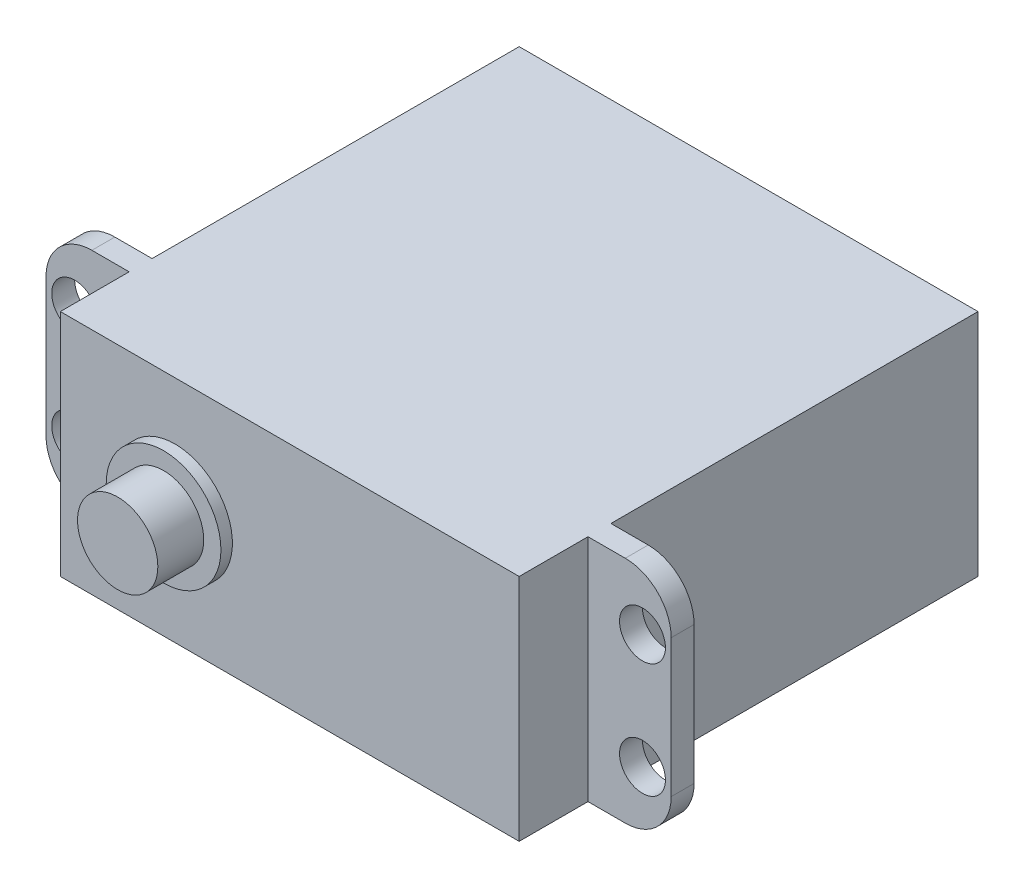
ISO-10303-21;
HEADER;
FILE_DESCRIPTION(('STEP AP214'),'2;1');
FILE_NAME('part.step','',(''),(''),'','','');
FILE_SCHEMA(('AUTOMOTIVE_DESIGN { 1 0 10303 214 1 1 1 1 }'));
ENDSEC;
DATA;
#1=APPLICATION_CONTEXT('core data for automotive mechanical design processes');
#2=APPLICATION_PROTOCOL_DEFINITION('international standard','automotive_design',2000,#1);
#3=PRODUCT_CONTEXT('',#1,'mechanical');
#4=PRODUCT('Part','Part','',(#3));
#5=PRODUCT_RELATED_PRODUCT_CATEGORY('part','',(#4));
#6=PRODUCT_DEFINITION_FORMATION('','',#4);
#7=PRODUCT_DEFINITION_CONTEXT('part definition',#1,'design');
#8=PRODUCT_DEFINITION('design','',#6,#7);
#9=PRODUCT_DEFINITION_SHAPE('','',#8);
#10=(LENGTH_UNIT() NAMED_UNIT(*) SI_UNIT(.MILLI.,.METRE.));
#11=(NAMED_UNIT(*) PLANE_ANGLE_UNIT() SI_UNIT($,.RADIAN.));
#12=(NAMED_UNIT(*) SI_UNIT($,.STERADIAN.) SOLID_ANGLE_UNIT());
#13=UNCERTAINTY_MEASURE_WITH_UNIT(LENGTH_MEASURE(1.E-05),#10,'distance_accuracy_value','');
#14=(GEOMETRIC_REPRESENTATION_CONTEXT(3) GLOBAL_UNCERTAINTY_ASSIGNED_CONTEXT((#13)) GLOBAL_UNIT_ASSIGNED_CONTEXT((#10,
#11,#12)) REPRESENTATION_CONTEXT('',''));
#15=CARTESIAN_POINT('',(0.,0.,0.));
#16=DIRECTION('',(0.,0.,1.));
#17=DIRECTION('',(1.,0.,0.));
#18=AXIS2_PLACEMENT_3D('',#15,#16,#17);
#19=CARTESIAN_POINT('',(-20.,-10.,40.));
#20=DIRECTION('',(-1.,0.,0.));
#21=DIRECTION('',(0.,0.,1.));
#22=AXIS2_PLACEMENT_3D('',#19,#20,#21);
#23=PLANE('',#22);
#24=DIRECTION('',(0.,-1.,0.));
#25=VECTOR('',#24,1.);
#26=CARTESIAN_POINT('',(-20.,10.,32.));
#27=LINE('',#26,#25);
#28=CARTESIAN_POINT('',(-20.,10.,32.));
#29=VERTEX_POINT('',#28);
#30=CARTESIAN_POINT('',(-20.,-10.,32.));
#31=VERTEX_POINT('',#30);
#32=EDGE_CURVE('E191',#29,#31,#27,.T.);
#33=ORIENTED_EDGE('',*,*,#32,.F.);
#34=DIRECTION('',(0.,0.,-1.));
#35=VECTOR('',#34,1.);
#36=CARTESIAN_POINT('',(-20.,10.,40.));
#37=LINE('',#36,#35);
#38=CARTESIAN_POINT('',(-20.,10.,0.));
#39=VERTEX_POINT('',#38);
#40=EDGE_CURVE('E186',#29,#39,#37,.T.);
#41=ORIENTED_EDGE('',*,*,#40,.T.);
#42=DIRECTION('',(0.,1.,0.));
#43=VECTOR('',#42,1.);
#44=CARTESIAN_POINT('',(-20.,-10.,0.));
#45=LINE('',#44,#43);
#46=CARTESIAN_POINT('',(-20.,-10.,0.));
#47=VERTEX_POINT('',#46);
#48=EDGE_CURVE('E249',#47,#39,#45,.T.);
#49=ORIENTED_EDGE('',*,*,#48,.F.);
#50=DIRECTION('',(0.,0.,-1.));
#51=VECTOR('',#50,1.);
#52=CARTESIAN_POINT('',(-20.,-10.,40.));
#53=LINE('',#52,#51);
#54=EDGE_CURVE('E288',#31,#47,#53,.T.);
#55=ORIENTED_EDGE('',*,*,#54,.F.);
#56=EDGE_LOOP('',(#33,#41,#49,#55));
#57=FACE_BOUND('',#56,.T.);
#58=ADVANCED_FACE('F45',(#57),#23,.T.);
#59=CARTESIAN_POINT('',(20.,-10.,40.));
#60=DIRECTION('',(-1.,0.,0.));
#61=DIRECTION('',(0.,0.,1.));
#62=AXIS2_PLACEMENT_3D('',#59,#60,#61);
#63=PLANE('',#62);
#64=DIRECTION('',(0.,0.,-1.));
#65=VECTOR('',#64,1.);
#66=CARTESIAN_POINT('',(20.,-10.,40.));
#67=LINE('',#66,#65);
#68=CARTESIAN_POINT('',(20.,-10.,40.));
#69=VERTEX_POINT('',#68);
#70=CARTESIAN_POINT('',(20.,-10.,34.));
#71=VERTEX_POINT('',#70);
#72=EDGE_CURVE('E289',#69,#71,#67,.T.);
#73=ORIENTED_EDGE('',*,*,#72,.T.);
#74=DIRECTION('',(0.,1.,0.));
#75=VECTOR('',#74,1.);
#76=CARTESIAN_POINT('',(20.,-10.,34.));
#77=LINE('',#76,#75);
#78=CARTESIAN_POINT('',(20.,10.,34.));
#79=VERTEX_POINT('',#78);
#80=EDGE_CURVE('E218',#71,#79,#77,.T.);
#81=ORIENTED_EDGE('',*,*,#80,.T.);
#82=DIRECTION('',(0.,0.,-1.));
#83=VECTOR('',#82,1.);
#84=CARTESIAN_POINT('',(20.,10.,40.));
#85=LINE('',#84,#83);
#86=CARTESIAN_POINT('',(20.,10.,40.));
#87=VERTEX_POINT('',#86);
#88=EDGE_CURVE('E294',#87,#79,#85,.T.);
#89=ORIENTED_EDGE('',*,*,#88,.F.);
#90=DIRECTION('',(0.,1.,0.));
#91=VECTOR('',#90,1.);
#92=CARTESIAN_POINT('',(20.,-10.,40.));
#93=LINE('',#92,#91);
#94=EDGE_CURVE('E264',#69,#87,#93,.T.);
#95=ORIENTED_EDGE('',*,*,#94,.F.);
#96=EDGE_LOOP('',(#73,#81,#89,#95));
#97=FACE_BOUND('',#96,.T.);
#98=ADVANCED_FACE('F392',(#97),#63,.F.);
#99=DIRECTION('',(0.,1.,0.));
#100=VECTOR('',#99,1.);
#101=CARTESIAN_POINT('',(-20.,-10.,34.));
#102=LINE('',#101,#100);
#103=CARTESIAN_POINT('',(-20.,-10.,34.));
#104=VERTEX_POINT('',#103);
#105=CARTESIAN_POINT('',(-20.,10.,34.));
#106=VERTEX_POINT('',#105);
#107=EDGE_CURVE('E180',#104,#106,#102,.T.);
#108=ORIENTED_EDGE('',*,*,#107,.F.);
#109=CARTESIAN_POINT('',(-20.,-10.,40.));
#110=VERTEX_POINT('',#109);
#111=EDGE_CURVE('E284',#110,#104,#53,.T.);
#112=ORIENTED_EDGE('',*,*,#111,.F.);
#113=DIRECTION('',(0.,1.,0.));
#114=VECTOR('',#113,1.);
#115=CARTESIAN_POINT('',(-20.,-10.,40.));
#116=LINE('',#115,#114);
#117=CARTESIAN_POINT('',(-20.,10.,40.));
#118=VERTEX_POINT('',#117);
#119=EDGE_CURVE('E183',#110,#118,#116,.T.);
#120=ORIENTED_EDGE('',*,*,#119,.T.);
#121=EDGE_CURVE('E165',#118,#106,#37,.T.);
#122=ORIENTED_EDGE('',*,*,#121,.T.);
#123=EDGE_LOOP('',(#108,#112,#120,#122));
#124=FACE_BOUND('',#123,.T.);
#125=ADVANCED_FACE('F179',(#124),#23,.T.);
#126=CARTESIAN_POINT('',(-20.,-10.,40.));
#127=DIRECTION('',(0.,1.,0.));
#128=DIRECTION('',(0.,0.,1.));
#129=AXIS2_PLACEMENT_3D('',#126,#127,#128);
#130=PLANE('',#129);
#131=DIRECTION('',(1.,0.,0.));
#132=VECTOR('',#131,1.);
#133=CARTESIAN_POINT('',(-27.25,-10.,34.));
#134=LINE('',#133,#132);
#135=CARTESIAN_POINT('',(-23.25,-10.,34.));
#136=VERTEX_POINT('',#135);
#137=EDGE_CURVE('E173',#136,#104,#134,.T.);
#138=ORIENTED_EDGE('',*,*,#137,.F.);
#139=DIRECTION('',(0.,0.,1.));
#140=VECTOR('',#139,1.);
#141=CARTESIAN_POINT('',(-23.25,-10.,32.));
#142=LINE('',#141,#140);
#143=CARTESIAN_POINT('',(-23.25,-10.,32.));
#144=VERTEX_POINT('',#143);
#145=EDGE_CURVE('E71',#136,#144,#142,.F.);
#146=ORIENTED_EDGE('',*,*,#145,.T.);
#147=DIRECTION('',(1.,0.,0.));
#148=VECTOR('',#147,1.);
#149=CARTESIAN_POINT('',(-27.25,-10.,32.));
#150=LINE('',#149,#148);
#151=EDGE_CURVE('E206',#144,#31,#150,.T.);
#152=ORIENTED_EDGE('',*,*,#151,.T.);
#153=ORIENTED_EDGE('',*,*,#54,.T.);
#154=DIRECTION('',(1.,0.,0.));
#155=VECTOR('',#154,1.);
#156=CARTESIAN_POINT('',(-20.,-10.,0.));
#157=LINE('',#156,#155);
#158=CARTESIAN_POINT('',(20.,-10.,0.));
#159=VERTEX_POINT('',#158);
#160=EDGE_CURVE('E261',#47,#159,#157,.T.);
#161=ORIENTED_EDGE('',*,*,#160,.T.);
#162=CARTESIAN_POINT('',(20.,-10.,32.));
#163=VERTEX_POINT('',#162);
#164=EDGE_CURVE('E293',#163,#159,#67,.T.);
#165=ORIENTED_EDGE('',*,*,#164,.F.);
#166=DIRECTION('',(-1.,0.,0.));
#167=VECTOR('',#166,1.);
#168=CARTESIAN_POINT('',(27.25,-10.,32.));
#169=LINE('',#168,#167);
#170=CARTESIAN_POINT('',(23.25,-10.,32.));
#171=VERTEX_POINT('',#170);
#172=EDGE_CURVE('E246',#171,#163,#169,.T.);
#173=ORIENTED_EDGE('',*,*,#172,.F.);
#174=DIRECTION('',(0.,0.,1.));
#175=VECTOR('',#174,1.);
#176=CARTESIAN_POINT('',(23.25,-10.,40.));
#177=LINE('',#176,#175);
#178=CARTESIAN_POINT('',(23.25,-10.,34.));
#179=VERTEX_POINT('',#178);
#180=EDGE_CURVE('E319',#171,#179,#177,.T.);
#181=ORIENTED_EDGE('',*,*,#180,.T.);
#182=DIRECTION('',(-1.,0.,0.));
#183=VECTOR('',#182,1.);
#184=CARTESIAN_POINT('',(27.25,-10.,34.));
#185=LINE('',#184,#183);
#186=EDGE_CURVE('E239',#179,#71,#185,.T.);
#187=ORIENTED_EDGE('',*,*,#186,.T.);
#188=ORIENTED_EDGE('',*,*,#72,.F.);
#189=DIRECTION('',(1.,0.,0.));
#190=VECTOR('',#189,1.);
#191=CARTESIAN_POINT('',(-20.,-10.,40.));
#192=LINE('',#191,#190);
#193=EDGE_CURVE('E267',#110,#69,#192,.T.);
#194=ORIENTED_EDGE('',*,*,#193,.F.);
#195=ORIENTED_EDGE('',*,*,#111,.T.);
#196=EDGE_LOOP('',(#138,#146,#152,#153,#161,#165,#173,#181,#187,#188,#194,#195));
#197=FACE_BOUND('',#196,.T.);
#198=ADVANCED_FACE('F382',(#197),#130,.F.);
#199=CARTESIAN_POINT('',(20.,10.,32.));
#200=VERTEX_POINT('',#199);
#201=CARTESIAN_POINT('',(20.,10.,0.));
#202=VERTEX_POINT('',#201);
#203=EDGE_CURVE('E185',#200,#202,#85,.T.);
#204=ORIENTED_EDGE('',*,*,#203,.F.);
#205=DIRECTION('',(0.,-1.,0.));
#206=VECTOR('',#205,1.);
#207=CARTESIAN_POINT('',(20.,10.,32.));
#208=LINE('',#207,#206);
#209=EDGE_CURVE('E235',#200,#163,#208,.T.);
#210=ORIENTED_EDGE('',*,*,#209,.T.);
#211=ORIENTED_EDGE('',*,*,#164,.T.);
#212=DIRECTION('',(0.,1.,0.));
#213=VECTOR('',#212,1.);
#214=CARTESIAN_POINT('',(20.,-10.,0.));
#215=LINE('',#214,#213);
#216=EDGE_CURVE('E277',#159,#202,#215,.T.);
#217=ORIENTED_EDGE('',*,*,#216,.T.);
#218=EDGE_LOOP('',(#204,#210,#211,#217));
#219=FACE_BOUND('',#218,.T.);
#220=ADVANCED_FACE('F411',(#219),#63,.F.);
#221=CARTESIAN_POINT('',(-20.,10.,40.));
#222=DIRECTION('',(0.,1.,0.));
#223=DIRECTION('',(0.,0.,1.));
#224=AXIS2_PLACEMENT_3D('',#221,#222,#223);
#225=PLANE('',#224);
#226=DIRECTION('',(1.,0.,0.));
#227=VECTOR('',#226,1.);
#228=CARTESIAN_POINT('',(-27.25,10.,32.));
#229=LINE('',#228,#227);
#230=CARTESIAN_POINT('',(-23.25,10.,32.));
#231=VERTEX_POINT('',#230);
#232=EDGE_CURVE('E174',#231,#29,#229,.T.);
#233=ORIENTED_EDGE('',*,*,#232,.F.);
#234=DIRECTION('',(0.,0.,-1.));
#235=VECTOR('',#234,1.);
#236=CARTESIAN_POINT('',(-23.25,10.,40.));
#237=LINE('',#236,#235);
#238=CARTESIAN_POINT('',(-23.25,10.,34.));
#239=VERTEX_POINT('',#238);
#240=EDGE_CURVE('E168',#231,#239,#237,.F.);
#241=ORIENTED_EDGE('',*,*,#240,.T.);
#242=DIRECTION('',(1.,0.,0.));
#243=VECTOR('',#242,1.);
#244=CARTESIAN_POINT('',(-27.25,10.,34.));
#245=LINE('',#244,#243);
#246=EDGE_CURVE('E161',#239,#106,#245,.T.);
#247=ORIENTED_EDGE('',*,*,#246,.T.);
#248=ORIENTED_EDGE('',*,*,#121,.F.);
#249=DIRECTION('',(1.,0.,0.));
#250=VECTOR('',#249,1.);
#251=CARTESIAN_POINT('',(-20.,10.,40.));
#252=LINE('',#251,#250);
#253=EDGE_CURVE('E260',#118,#87,#252,.T.);
#254=ORIENTED_EDGE('',*,*,#253,.T.);
#255=ORIENTED_EDGE('',*,*,#88,.T.);
#256=DIRECTION('',(-1.,0.,0.));
#257=VECTOR('',#256,1.);
#258=CARTESIAN_POINT('',(27.25,10.,34.));
#259=LINE('',#258,#257);
#260=CARTESIAN_POINT('',(23.25,10.,34.));
#261=VERTEX_POINT('',#260);
#262=EDGE_CURVE('E253',#261,#79,#259,.T.);
#263=ORIENTED_EDGE('',*,*,#262,.F.);
#264=DIRECTION('',(0.,0.,-1.));
#265=VECTOR('',#264,1.);
#266=CARTESIAN_POINT('',(23.25,10.,32.));
#267=LINE('',#266,#265);
#268=CARTESIAN_POINT('',(23.25,10.,32.));
#269=VERTEX_POINT('',#268);
#270=EDGE_CURVE('E287',#261,#269,#267,.T.);
#271=ORIENTED_EDGE('',*,*,#270,.T.);
#272=DIRECTION('',(-1.,0.,0.));
#273=VECTOR('',#272,1.);
#274=CARTESIAN_POINT('',(27.25,10.,32.));
#275=LINE('',#274,#273);
#276=EDGE_CURVE('E250',#269,#200,#275,.T.);
#277=ORIENTED_EDGE('',*,*,#276,.T.);
#278=ORIENTED_EDGE('',*,*,#203,.T.);
#279=DIRECTION('',(1.,0.,0.));
#280=VECTOR('',#279,1.);
#281=CARTESIAN_POINT('',(-20.,10.,0.));
#282=LINE('',#281,#280);
#283=EDGE_CURVE('E273',#39,#202,#282,.T.);
#284=ORIENTED_EDGE('',*,*,#283,.F.);
#285=ORIENTED_EDGE('',*,*,#40,.F.);
#286=EDGE_LOOP('',(#233,#241,#247,#248,#254,#255,#263,#271,#277,#278,#284,#285));
#287=FACE_BOUND('',#286,.T.);
#288=ADVANCED_FACE('F163',(#287),#225,.T.);
#289=CARTESIAN_POINT('',(0.,0.,40.));
#290=DIRECTION('',(0.,0.,-1.));
#291=DIRECTION('',(-1.,0.,0.));
#292=AXIS2_PLACEMENT_3D('',#289,#290,#291);
#293=PLANE('',#292);
#294=CARTESIAN_POINT('',(-10.,0.,40.));
#295=DIRECTION('',(0.,0.,-1.));
#296=DIRECTION('',(-1.,0.,0.));
#297=AXIS2_PLACEMENT_3D('',#294,#295,#296);
#298=CIRCLE('',#297,5.);
#299=CARTESIAN_POINT('',(-15.,0.,40.));
#300=VERTEX_POINT('',#299);
#301=EDGE_CURVE('E49',#300,#300,#298,.F.);
#302=ORIENTED_EDGE('',*,*,#301,.F.);
#303=EDGE_LOOP('',(#302));
#304=FACE_BOUND('',#303,.T.);
#305=ORIENTED_EDGE('',*,*,#119,.F.);
#306=ORIENTED_EDGE('',*,*,#193,.T.);
#307=ORIENTED_EDGE('',*,*,#94,.T.);
#308=ORIENTED_EDGE('',*,*,#253,.F.);
#309=EDGE_LOOP('',(#305,#306,#307,#308));
#310=FACE_BOUND('',#309,.T.);
#311=ADVANCED_FACE('F387',(#304,#310),#293,.F.);
#312=CARTESIAN_POINT('',(0.,0.,0.));
#313=DIRECTION('',(0.,0.,-1.));
#314=DIRECTION('',(-1.,0.,0.));
#315=AXIS2_PLACEMENT_3D('',#312,#313,#314);
#316=PLANE('',#315);
#317=CARTESIAN_POINT('',(-10.,0.,0.));
#318=DIRECTION('',(0.,0.,-1.));
#319=DIRECTION('',(-1.,0.,0.));
#320=AXIS2_PLACEMENT_3D('',#317,#318,#319);
#321=CIRCLE('',#320,5.);
#322=CARTESIAN_POINT('',(-15.,0.,0.));
#323=VERTEX_POINT('',#322);
#324=EDGE_CURVE('E533',#323,#323,#321,.T.);
#325=ORIENTED_EDGE('',*,*,#324,.F.);
#326=EDGE_LOOP('',(#325));
#327=FACE_BOUND('',#326,.T.);
#328=ORIENTED_EDGE('',*,*,#48,.T.);
#329=ORIENTED_EDGE('',*,*,#283,.T.);
#330=ORIENTED_EDGE('',*,*,#216,.F.);
#331=ORIENTED_EDGE('',*,*,#160,.F.);
#332=EDGE_LOOP('',(#328,#329,#330,#331));
#333=FACE_BOUND('',#332,.T.);
#334=ADVANCED_FACE('F424',(#327,#333),#316,.T.);
#335=CARTESIAN_POINT('',(27.25,10.,32.));
#336=DIRECTION('',(0.,0.,-1.));
#337=DIRECTION('',(-1.,0.,0.));
#338=AXIS2_PLACEMENT_3D('',#335,#336,#337);
#339=PLANE('',#338);
#340=CARTESIAN_POINT('',(24.75,4.99942998703595,32.));
#341=DIRECTION('',(0.,0.,1.));
#342=DIRECTION('',(1.,0.,0.));
#343=AXIS2_PLACEMENT_3D('',#340,#341,#342);
#344=CIRCLE('',#343,2.);
#345=CARTESIAN_POINT('',(26.75,4.99942998703595,32.));
#346=VERTEX_POINT('',#345);
#347=EDGE_CURVE('E214',#346,#346,#344,.T.);
#348=ORIENTED_EDGE('',*,*,#347,.T.);
#349=EDGE_LOOP('',(#348));
#350=FACE_BOUND('',#349,.T.);
#351=CARTESIAN_POINT('',(24.75,-4.99913934048573,32.));
#352=DIRECTION('',(0.,0.,1.));
#353=DIRECTION('',(1.,0.,0.));
#354=AXIS2_PLACEMENT_3D('',#351,#352,#353);
#355=CIRCLE('',#354,2.);
#356=CARTESIAN_POINT('',(26.75,-4.99913934048573,32.));
#357=VERTEX_POINT('',#356);
#358=EDGE_CURVE('E213',#357,#357,#355,.T.);
#359=ORIENTED_EDGE('',*,*,#358,.T.);
#360=EDGE_LOOP('',(#359));
#361=FACE_BOUND('',#360,.T.);
#362=ORIENTED_EDGE('',*,*,#276,.F.);
#363=CARTESIAN_POINT('',(23.25,6.,32.));
#364=DIRECTION('',(0.,0.,-1.));
#365=DIRECTION('',(-1.,0.,0.));
#366=AXIS2_PLACEMENT_3D('',#363,#364,#365);
#367=CIRCLE('',#366,4.);
#368=CARTESIAN_POINT('',(27.25,6.,32.));
#369=VERTEX_POINT('',#368);
#370=EDGE_CURVE('E304',#269,#369,#367,.T.);
#371=ORIENTED_EDGE('',*,*,#370,.T.);
#372=DIRECTION('',(0.,-1.,0.));
#373=VECTOR('',#372,1.);
#374=CARTESIAN_POINT('',(27.25,10.,32.));
#375=LINE('',#374,#373);
#376=CARTESIAN_POINT('',(27.25,-6.,32.));
#377=VERTEX_POINT('',#376);
#378=EDGE_CURVE('E234',#369,#377,#375,.T.);
#379=ORIENTED_EDGE('',*,*,#378,.T.);
#380=CARTESIAN_POINT('',(23.25,-6.,32.));
#381=DIRECTION('',(0.,0.,-1.));
#382=DIRECTION('',(-1.,0.,0.));
#383=AXIS2_PLACEMENT_3D('',#380,#381,#382);
#384=CIRCLE('',#383,4.);
#385=EDGE_CURVE('E301',#377,#171,#384,.T.);
#386=ORIENTED_EDGE('',*,*,#385,.T.);
#387=ORIENTED_EDGE('',*,*,#172,.T.);
#388=ORIENTED_EDGE('',*,*,#209,.F.);
#389=EDGE_LOOP('',(#362,#371,#379,#386,#387,#388));
#390=FACE_BOUND('',#389,.T.);
#391=ADVANCED_FACE('F405',(#350,#361,#390),#339,.T.);
#392=CARTESIAN_POINT('',(27.25,-10.,34.));
#393=DIRECTION('',(0.,0.,1.));
#394=DIRECTION('',(1.,0.,0.));
#395=AXIS2_PLACEMENT_3D('',#392,#393,#394);
#396=PLANE('',#395);
#397=CARTESIAN_POINT('',(24.75,4.99942998703595,34.));
#398=DIRECTION('',(0.,0.,1.));
#399=DIRECTION('',(1.,0.,0.));
#400=AXIS2_PLACEMENT_3D('',#397,#398,#399);
#401=CIRCLE('',#400,2.);
#402=CARTESIAN_POINT('',(26.75,4.99942998703595,34.));
#403=VERTEX_POINT('',#402);
#404=EDGE_CURVE('E219',#403,#403,#401,.T.);
#405=ORIENTED_EDGE('',*,*,#404,.F.);
#406=EDGE_LOOP('',(#405));
#407=FACE_BOUND('',#406,.T.);
#408=CARTESIAN_POINT('',(24.75,-4.99913934048573,34.));
#409=DIRECTION('',(0.,0.,1.));
#410=DIRECTION('',(1.,0.,0.));
#411=AXIS2_PLACEMENT_3D('',#408,#409,#410);
#412=CIRCLE('',#411,2.);
#413=CARTESIAN_POINT('',(26.75,-4.99913934048573,34.));
#414=VERTEX_POINT('',#413);
#415=EDGE_CURVE('E223',#414,#414,#412,.T.);
#416=ORIENTED_EDGE('',*,*,#415,.F.);
#417=EDGE_LOOP('',(#416));
#418=FACE_BOUND('',#417,.T.);
#419=DIRECTION('',(0.,1.,0.));
#420=VECTOR('',#419,1.);
#421=CARTESIAN_POINT('',(27.25,-10.,34.));
#422=LINE('',#421,#420);
#423=CARTESIAN_POINT('',(27.25,-6.,34.));
#424=VERTEX_POINT('',#423);
#425=CARTESIAN_POINT('',(27.25,6.,34.));
#426=VERTEX_POINT('',#425);
#427=EDGE_CURVE('E230',#424,#426,#422,.T.);
#428=ORIENTED_EDGE('',*,*,#427,.T.);
#429=CARTESIAN_POINT('',(23.25,6.,34.));
#430=DIRECTION('',(0.,0.,1.));
#431=DIRECTION('',(1.,0.,0.));
#432=AXIS2_PLACEMENT_3D('',#429,#430,#431);
#433=CIRCLE('',#432,4.);
#434=EDGE_CURVE('E316',#426,#261,#433,.T.);
#435=ORIENTED_EDGE('',*,*,#434,.T.);
#436=ORIENTED_EDGE('',*,*,#262,.T.);
#437=ORIENTED_EDGE('',*,*,#80,.F.);
#438=ORIENTED_EDGE('',*,*,#186,.F.);
#439=CARTESIAN_POINT('',(23.25,-6.,34.));
#440=DIRECTION('',(0.,0.,1.));
#441=DIRECTION('',(1.,0.,0.));
#442=AXIS2_PLACEMENT_3D('',#439,#440,#441);
#443=CIRCLE('',#442,4.);
#444=EDGE_CURVE('E313',#179,#424,#443,.T.);
#445=ORIENTED_EDGE('',*,*,#444,.T.);
#446=EDGE_LOOP('',(#428,#435,#436,#437,#438,#445));
#447=FACE_BOUND('',#446,.T.);
#448=ADVANCED_FACE('F396',(#407,#418,#447),#396,.T.);
#449=CARTESIAN_POINT('',(27.25,0.,0.));
#450=DIRECTION('',(-1.,0.,0.));
#451=DIRECTION('',(0.,0.,1.));
#452=AXIS2_PLACEMENT_3D('',#449,#450,#451);
#453=PLANE('',#452);
#454=ORIENTED_EDGE('',*,*,#378,.F.);
#455=DIRECTION('',(0.,0.,-1.));
#456=VECTOR('',#455,1.);
#457=CARTESIAN_POINT('',(27.25,6.,34.));
#458=LINE('',#457,#456);
#459=EDGE_CURVE('E310',#369,#426,#458,.F.);
#460=ORIENTED_EDGE('',*,*,#459,.T.);
#461=ORIENTED_EDGE('',*,*,#427,.F.);
#462=DIRECTION('',(0.,0.,1.));
#463=VECTOR('',#462,1.);
#464=CARTESIAN_POINT('',(27.25,-6.,0.));
#465=LINE('',#464,#463);
#466=EDGE_CURVE('E307',#424,#377,#465,.F.);
#467=ORIENTED_EDGE('',*,*,#466,.T.);
#468=EDGE_LOOP('',(#454,#460,#461,#467));
#469=FACE_BOUND('',#468,.T.);
#470=ADVANCED_FACE('F472',(#469),#453,.F.);
#471=CARTESIAN_POINT('',(24.75,-4.99913934048573,32.));
#472=DIRECTION('',(0.,0.,1.));
#473=DIRECTION('',(1.,0.,0.));
#474=AXIS2_PLACEMENT_3D('',#471,#472,#473);
#475=CYLINDRICAL_SURFACE('',#474,2.);
#476=ORIENTED_EDGE('',*,*,#358,.F.);
#477=EDGE_LOOP('',(#476));
#478=FACE_BOUND('',#477,.T.);
#479=ORIENTED_EDGE('',*,*,#415,.T.);
#480=EDGE_LOOP('',(#479));
#481=FACE_BOUND('',#480,.T.);
#482=ADVANCED_FACE('F479',(#478,#481),#475,.F.);
#483=CARTESIAN_POINT('',(24.75,4.99942998703595,32.));
#484=DIRECTION('',(0.,0.,1.));
#485=DIRECTION('',(1.,0.,0.));
#486=AXIS2_PLACEMENT_3D('',#483,#484,#485);
#487=CYLINDRICAL_SURFACE('',#486,2.);
#488=ORIENTED_EDGE('',*,*,#347,.F.);
#489=EDGE_LOOP('',(#488));
#490=FACE_BOUND('',#489,.T.);
#491=ORIENTED_EDGE('',*,*,#404,.T.);
#492=EDGE_LOOP('',(#491));
#493=FACE_BOUND('',#492,.T.);
#494=ADVANCED_FACE('F483',(#490,#493),#487,.F.);
#495=CARTESIAN_POINT('',(23.25,6.,40.));
#496=DIRECTION('',(0.,0.,1.));
#497=DIRECTION('',(1.,0.,0.));
#498=AXIS2_PLACEMENT_3D('',#495,#496,#497);
#499=CYLINDRICAL_SURFACE('',#498,4.);
#500=ORIENTED_EDGE('',*,*,#434,.F.);
#501=ORIENTED_EDGE('',*,*,#459,.F.);
#502=ORIENTED_EDGE('',*,*,#370,.F.);
#503=ORIENTED_EDGE('',*,*,#270,.F.);
#504=EDGE_LOOP('',(#500,#501,#502,#503));
#505=FACE_BOUND('',#504,.T.);
#506=ADVANCED_FACE('F401',(#505),#499,.T.);
#507=CARTESIAN_POINT('',(23.25,-6.,40.));
#508=DIRECTION('',(0.,0.,1.));
#509=DIRECTION('',(1.,0.,0.));
#510=AXIS2_PLACEMENT_3D('',#507,#508,#509);
#511=CYLINDRICAL_SURFACE('',#510,4.);
#512=ORIENTED_EDGE('',*,*,#385,.F.);
#513=ORIENTED_EDGE('',*,*,#466,.F.);
#514=ORIENTED_EDGE('',*,*,#444,.F.);
#515=ORIENTED_EDGE('',*,*,#180,.F.);
#516=EDGE_LOOP('',(#512,#513,#514,#515));
#517=FACE_BOUND('',#516,.T.);
#518=ADVANCED_FACE('F489',(#517),#511,.T.);
#519=CARTESIAN_POINT('',(-27.25,-10.,34.));
#520=DIRECTION('',(0.,0.,-1.));
#521=DIRECTION('',(-1.,0.,0.));
#522=AXIS2_PLACEMENT_3D('',#519,#520,#521);
#523=PLANE('',#522);
#524=CARTESIAN_POINT('',(-24.75,5.,34.));
#525=DIRECTION('',(0.,0.,1.));
#526=DIRECTION('',(1.,0.,0.));
#527=AXIS2_PLACEMENT_3D('',#524,#525,#526);
#528=CIRCLE('',#527,2.);
#529=CARTESIAN_POINT('',(-22.75,5.,34.));
#530=VERTEX_POINT('',#529);
#531=EDGE_CURVE('E200',#530,#530,#528,.T.);
#532=ORIENTED_EDGE('',*,*,#531,.F.);
#533=EDGE_LOOP('',(#532));
#534=FACE_BOUND('',#533,.T.);
#535=CARTESIAN_POINT('',(-24.75,-5.,34.));
#536=DIRECTION('',(0.,0.,1.));
#537=DIRECTION('',(1.,0.,0.));
#538=AXIS2_PLACEMENT_3D('',#535,#536,#537);
#539=CIRCLE('',#538,2.);
#540=CARTESIAN_POINT('',(-22.75,-5.,34.));
#541=VERTEX_POINT('',#540);
#542=EDGE_CURVE('E365',#541,#541,#539,.T.);
#543=ORIENTED_EDGE('',*,*,#542,.F.);
#544=EDGE_LOOP('',(#543));
#545=FACE_BOUND('',#544,.T.);
#546=DIRECTION('',(0.,1.,0.));
#547=VECTOR('',#546,1.);
#548=CARTESIAN_POINT('',(-27.25,-10.,34.));
#549=LINE('',#548,#547);
#550=CARTESIAN_POINT('',(-27.25,-6.,34.));
#551=VERTEX_POINT('',#550);
#552=CARTESIAN_POINT('',(-27.25,6.,34.));
#553=VERTEX_POINT('',#552);
#554=EDGE_CURVE('E197',#551,#553,#549,.T.);
#555=ORIENTED_EDGE('',*,*,#554,.F.);
#556=CARTESIAN_POINT('',(-23.25,-6.,34.));
#557=DIRECTION('',(0.,0.,-1.));
#558=DIRECTION('',(-1.,0.,0.));
#559=AXIS2_PLACEMENT_3D('',#556,#557,#558);
#560=CIRCLE('',#559,4.);
#561=EDGE_CURVE('E334',#551,#136,#560,.F.);
#562=ORIENTED_EDGE('',*,*,#561,.T.);
#563=ORIENTED_EDGE('',*,*,#137,.T.);
#564=ORIENTED_EDGE('',*,*,#107,.T.);
#565=ORIENTED_EDGE('',*,*,#246,.F.);
#566=CARTESIAN_POINT('',(-23.25,6.,34.));
#567=DIRECTION('',(0.,0.,-1.));
#568=DIRECTION('',(-1.,0.,0.));
#569=AXIS2_PLACEMENT_3D('',#566,#567,#568);
#570=CIRCLE('',#569,4.);
#571=EDGE_CURVE('E331',#239,#553,#570,.F.);
#572=ORIENTED_EDGE('',*,*,#571,.T.);
#573=EDGE_LOOP('',(#555,#562,#563,#564,#565,#572));
#574=FACE_BOUND('',#573,.T.);
#575=ADVANCED_FACE('F189',(#534,#545,#574),#523,.F.);
#576=CARTESIAN_POINT('',(-27.25,10.,32.));
#577=DIRECTION('',(0.,0.,1.));
#578=DIRECTION('',(1.,0.,0.));
#579=AXIS2_PLACEMENT_3D('',#576,#577,#578);
#580=PLANE('',#579);
#581=CARTESIAN_POINT('',(-24.75,5.,32.));
#582=DIRECTION('',(0.,0.,1.));
#583=DIRECTION('',(1.,0.,0.));
#584=AXIS2_PLACEMENT_3D('',#581,#582,#583);
#585=CIRCLE('',#584,2.);
#586=CARTESIAN_POINT('',(-22.75,5.,32.));
#587=VERTEX_POINT('',#586);
#588=EDGE_CURVE('E192',#587,#587,#585,.T.);
#589=ORIENTED_EDGE('',*,*,#588,.T.);
#590=EDGE_LOOP('',(#589));
#591=FACE_BOUND('',#590,.T.);
#592=CARTESIAN_POINT('',(-24.75,-5.,32.));
#593=DIRECTION('',(0.,0.,1.));
#594=DIRECTION('',(1.,0.,0.));
#595=AXIS2_PLACEMENT_3D('',#592,#593,#594);
#596=CIRCLE('',#595,2.);
#597=CARTESIAN_POINT('',(-22.75,-5.,32.));
#598=VERTEX_POINT('',#597);
#599=EDGE_CURVE('E360',#598,#598,#596,.T.);
#600=ORIENTED_EDGE('',*,*,#599,.T.);
#601=EDGE_LOOP('',(#600));
#602=FACE_BOUND('',#601,.T.);
#603=ORIENTED_EDGE('',*,*,#151,.F.);
#604=CARTESIAN_POINT('',(-23.25,-6.,32.));
#605=DIRECTION('',(0.,0.,1.));
#606=DIRECTION('',(1.,0.,0.));
#607=AXIS2_PLACEMENT_3D('',#604,#605,#606);
#608=CIRCLE('',#607,4.);
#609=CARTESIAN_POINT('',(-27.25,-6.,32.));
#610=VERTEX_POINT('',#609);
#611=EDGE_CURVE('E341',#144,#610,#608,.F.);
#612=ORIENTED_EDGE('',*,*,#611,.T.);
#613=DIRECTION('',(0.,-1.,0.));
#614=VECTOR('',#613,1.);
#615=CARTESIAN_POINT('',(-27.25,10.,32.));
#616=LINE('',#615,#614);
#617=CARTESIAN_POINT('',(-27.25,6.,32.));
#618=VERTEX_POINT('',#617);
#619=EDGE_CURVE('E203',#618,#610,#616,.T.);
#620=ORIENTED_EDGE('',*,*,#619,.F.);
#621=CARTESIAN_POINT('',(-23.25,6.,32.));
#622=DIRECTION('',(0.,0.,1.));
#623=DIRECTION('',(1.,0.,0.));
#624=AXIS2_PLACEMENT_3D('',#621,#622,#623);
#625=CIRCLE('',#624,4.);
#626=EDGE_CURVE('E63',#618,#231,#625,.F.);
#627=ORIENTED_EDGE('',*,*,#626,.T.);
#628=ORIENTED_EDGE('',*,*,#232,.T.);
#629=ORIENTED_EDGE('',*,*,#32,.T.);
#630=EDGE_LOOP('',(#603,#612,#620,#627,#628,#629));
#631=FACE_BOUND('',#630,.T.);
#632=ADVANCED_FACE('F426',(#591,#602,#631),#580,.F.);
#633=CARTESIAN_POINT('',(-27.25,0.,0.));
#634=DIRECTION('',(-1.,0.,0.));
#635=DIRECTION('',(0.,0.,1.));
#636=AXIS2_PLACEMENT_3D('',#633,#634,#635);
#637=PLANE('',#636);
#638=ORIENTED_EDGE('',*,*,#619,.T.);
#639=DIRECTION('',(0.,0.,1.));
#640=VECTOR('',#639,1.);
#641=CARTESIAN_POINT('',(-27.25,-6.,34.));
#642=LINE('',#641,#640);
#643=EDGE_CURVE('E327',#610,#551,#642,.T.);
#644=ORIENTED_EDGE('',*,*,#643,.T.);
#645=ORIENTED_EDGE('',*,*,#554,.T.);
#646=DIRECTION('',(0.,0.,-1.));
#647=VECTOR('',#646,1.);
#648=CARTESIAN_POINT('',(-27.25,6.,0.));
#649=LINE('',#648,#647);
#650=EDGE_CURVE('E323',#553,#618,#649,.T.);
#651=ORIENTED_EDGE('',*,*,#650,.T.);
#652=EDGE_LOOP('',(#638,#644,#645,#651));
#653=FACE_BOUND('',#652,.T.);
#654=ADVANCED_FACE('F378',(#653),#637,.T.);
#655=CARTESIAN_POINT('',(-24.75,-5.,32.));
#656=DIRECTION('',(0.,0.,1.));
#657=DIRECTION('',(1.,0.,0.));
#658=AXIS2_PLACEMENT_3D('',#655,#656,#657);
#659=CYLINDRICAL_SURFACE('',#658,2.);
#660=ORIENTED_EDGE('',*,*,#599,.F.);
#661=EDGE_LOOP('',(#660));
#662=FACE_BOUND('',#661,.T.);
#663=ORIENTED_EDGE('',*,*,#542,.T.);
#664=EDGE_LOOP('',(#663));
#665=FACE_BOUND('',#664,.T.);
#666=ADVANCED_FACE('F496',(#662,#665),#659,.F.);
#667=CARTESIAN_POINT('',(-24.75,5.,32.));
#668=DIRECTION('',(0.,0.,1.));
#669=DIRECTION('',(1.,0.,0.));
#670=AXIS2_PLACEMENT_3D('',#667,#668,#669);
#671=CYLINDRICAL_SURFACE('',#670,2.);
#672=ORIENTED_EDGE('',*,*,#588,.F.);
#673=EDGE_LOOP('',(#672));
#674=FACE_BOUND('',#673,.T.);
#675=ORIENTED_EDGE('',*,*,#531,.T.);
#676=EDGE_LOOP('',(#675));
#677=FACE_BOUND('',#676,.T.);
#678=ADVANCED_FACE('F438',(#674,#677),#671,.F.);
#679=CARTESIAN_POINT('',(-23.25,-6.,0.));
#680=DIRECTION('',(0.,0.,-1.));
#681=DIRECTION('',(-1.,0.,0.));
#682=AXIS2_PLACEMENT_3D('',#679,#680,#681);
#683=CYLINDRICAL_SURFACE('',#682,4.);
#684=ORIENTED_EDGE('',*,*,#611,.F.);
#685=ORIENTED_EDGE('',*,*,#145,.F.);
#686=ORIENTED_EDGE('',*,*,#561,.F.);
#687=ORIENTED_EDGE('',*,*,#643,.F.);
#688=EDGE_LOOP('',(#684,#685,#686,#687));
#689=FACE_BOUND('',#688,.T.);
#690=ADVANCED_FACE('F381',(#689),#683,.T.);
#691=CARTESIAN_POINT('',(-23.25,6.,0.));
#692=DIRECTION('',(0.,0.,-1.));
#693=DIRECTION('',(-1.,0.,0.));
#694=AXIS2_PLACEMENT_3D('',#691,#692,#693);
#695=CYLINDRICAL_SURFACE('',#694,4.);
#696=ORIENTED_EDGE('',*,*,#571,.F.);
#697=ORIENTED_EDGE('',*,*,#240,.F.);
#698=ORIENTED_EDGE('',*,*,#626,.F.);
#699=ORIENTED_EDGE('',*,*,#650,.F.);
#700=EDGE_LOOP('',(#696,#697,#698,#699));
#701=FACE_BOUND('',#700,.T.);
#702=ADVANCED_FACE('F47',(#701),#695,.T.);
#703=CARTESIAN_POINT('',(-10.,0.,41.));
#704=DIRECTION('',(0.,0.,-1.));
#705=DIRECTION('',(-1.,0.,0.));
#706=AXIS2_PLACEMENT_3D('',#703,#704,#705);
#707=CYLINDRICAL_SURFACE('',#706,5.);
#708=CARTESIAN_POINT('',(-10.,0.,41.));
#709=DIRECTION('',(0.,0.,1.));
#710=DIRECTION('',(1.,0.,0.));
#711=AXIS2_PLACEMENT_3D('',#708,#709,#710);
#712=CIRCLE('',#711,5.);
#713=CARTESIAN_POINT('',(-5.,0.,41.));
#714=VERTEX_POINT('',#713);
#715=EDGE_CURVE('E357',#714,#714,#712,.T.);
#716=ORIENTED_EDGE('',*,*,#715,.F.);
#717=EDGE_LOOP('',(#716));
#718=FACE_BOUND('',#717,.T.);
#719=ORIENTED_EDGE('',*,*,#301,.T.);
#720=EDGE_LOOP('',(#719));
#721=FACE_BOUND('',#720,.T.);
#722=ADVANCED_FACE('F429',(#718,#721),#707,.T.);
#723=CARTESIAN_POINT('',(-10.,0.,41.));
#724=DIRECTION('',(0.,0.,1.));
#725=DIRECTION('',(1.,0.,0.));
#726=AXIS2_PLACEMENT_3D('',#723,#724,#725);
#727=PLANE('',#726);
#728=CARTESIAN_POINT('',(-10.,0.,41.));
#729=DIRECTION('',(0.,0.,1.));
#730=DIRECTION('',(1.,0.,0.));
#731=AXIS2_PLACEMENT_3D('',#728,#729,#730);
#732=CIRCLE('',#731,3.5);
#733=CARTESIAN_POINT('',(-6.5,0.,41.));
#734=VERTEX_POINT('',#733);
#735=EDGE_CURVE('E55',#734,#734,#732,.T.);
#736=ORIENTED_EDGE('',*,*,#735,.F.);
#737=EDGE_LOOP('',(#736));
#738=FACE_BOUND('',#737,.T.);
#739=ORIENTED_EDGE('',*,*,#715,.T.);
#740=EDGE_LOOP('',(#739));
#741=FACE_BOUND('',#740,.T.);
#742=ADVANCED_FACE('F435',(#738,#741),#727,.T.);
#743=CARTESIAN_POINT('',(-10.,0.,45.));
#744=DIRECTION('',(0.,0.,-1.));
#745=DIRECTION('',(-1.,0.,0.));
#746=AXIS2_PLACEMENT_3D('',#743,#744,#745);
#747=CYLINDRICAL_SURFACE('',#746,3.5);
#748=CARTESIAN_POINT('',(-10.,0.,45.));
#749=DIRECTION('',(0.,0.,1.));
#750=DIRECTION('',(1.,0.,0.));
#751=AXIS2_PLACEMENT_3D('',#748,#749,#750);
#752=CIRCLE('',#751,3.5);
#753=CARTESIAN_POINT('',(-6.5,0.,45.));
#754=VERTEX_POINT('',#753);
#755=EDGE_CURVE('E355',#754,#754,#752,.T.);
#756=ORIENTED_EDGE('',*,*,#755,.F.);
#757=EDGE_LOOP('',(#756));
#758=FACE_BOUND('',#757,.T.);
#759=ORIENTED_EDGE('',*,*,#735,.T.);
#760=EDGE_LOOP('',(#759));
#761=FACE_BOUND('',#760,.T.);
#762=ADVANCED_FACE('F503',(#758,#761),#747,.T.);
#763=CARTESIAN_POINT('',(-10.,0.,45.));
#764=DIRECTION('',(0.,0.,1.));
#765=DIRECTION('',(1.,0.,0.));
#766=AXIS2_PLACEMENT_3D('',#763,#764,#765);
#767=PLANE('',#766);
#768=ORIENTED_EDGE('',*,*,#755,.T.);
#769=EDGE_LOOP('',(#768));
#770=FACE_BOUND('',#769,.T.);
#771=ADVANCED_FACE('F507',(#770),#767,.T.);
#772=CARTESIAN_POINT('',(-10.,0.,-1.));
#773=DIRECTION('',(0.,0.,1.));
#774=DIRECTION('',(1.,0.,0.));
#775=AXIS2_PLACEMENT_3D('',#772,#773,#774);
#776=CYLINDRICAL_SURFACE('',#775,5.);
#777=CARTESIAN_POINT('',(-10.,0.,-1.));
#778=DIRECTION('',(0.,0.,-1.));
#779=DIRECTION('',(-1.,0.,0.));
#780=AXIS2_PLACEMENT_3D('',#777,#778,#779);
#781=CIRCLE('',#780,5.);
#782=CARTESIAN_POINT('',(-15.,0.,-1.));
#783=VERTEX_POINT('',#782);
#784=EDGE_CURVE('E537',#783,#783,#781,.T.);
#785=ORIENTED_EDGE('',*,*,#784,.F.);
#786=EDGE_LOOP('',(#785));
#787=FACE_BOUND('',#786,.T.);
#788=ORIENTED_EDGE('',*,*,#324,.T.);
#789=EDGE_LOOP('',(#788));
#790=FACE_BOUND('',#789,.T.);
#791=ADVANCED_FACE('F511',(#787,#790),#776,.T.);
#792=CARTESIAN_POINT('',(-10.,0.,-1.));
#793=DIRECTION('',(0.,0.,-1.));
#794=DIRECTION('',(-1.,0.,0.));
#795=AXIS2_PLACEMENT_3D('',#792,#793,#794);
#796=PLANE('',#795);
#797=CARTESIAN_POINT('',(-10.,0.,-1.));
#798=DIRECTION('',(0.,0.,-1.));
#799=DIRECTION('',(-1.,0.,0.));
#800=AXIS2_PLACEMENT_3D('',#797,#798,#799);
#801=CIRCLE('',#800,3.5);
#802=CARTESIAN_POINT('',(-13.5,0.,-1.));
#803=VERTEX_POINT('',#802);
#804=EDGE_CURVE('E11',#803,#803,#801,.T.);
#805=ORIENTED_EDGE('',*,*,#804,.F.);
#806=EDGE_LOOP('',(#805));
#807=FACE_BOUND('',#806,.T.);
#808=ORIENTED_EDGE('',*,*,#784,.T.);
#809=EDGE_LOOP('',(#808));
#810=FACE_BOUND('',#809,.T.);
#811=ADVANCED_FACE('F515',(#807,#810),#796,.T.);
#812=CARTESIAN_POINT('',(-10.,0.,-5.));
#813=DIRECTION('',(0.,0.,1.));
#814=DIRECTION('',(1.,0.,0.));
#815=AXIS2_PLACEMENT_3D('',#812,#813,#814);
#816=CYLINDRICAL_SURFACE('',#815,3.5);
#817=CARTESIAN_POINT('',(-10.,0.,-5.));
#818=DIRECTION('',(0.,0.,-1.));
#819=DIRECTION('',(-1.,0.,0.));
#820=AXIS2_PLACEMENT_3D('',#817,#818,#819);
#821=CIRCLE('',#820,3.5);
#822=CARTESIAN_POINT('',(-13.5,0.,-5.));
#823=VERTEX_POINT('',#822);
#824=EDGE_CURVE('E531',#823,#823,#821,.T.);
#825=ORIENTED_EDGE('',*,*,#824,.F.);
#826=EDGE_LOOP('',(#825));
#827=FACE_BOUND('',#826,.T.);
#828=ORIENTED_EDGE('',*,*,#804,.T.);
#829=EDGE_LOOP('',(#828));
#830=FACE_BOUND('',#829,.T.);
#831=ADVANCED_FACE('F519',(#827,#830),#816,.T.);
#832=CARTESIAN_POINT('',(-10.,0.,-5.));
#833=DIRECTION('',(0.,0.,-1.));
#834=DIRECTION('',(-1.,0.,0.));
#835=AXIS2_PLACEMENT_3D('',#832,#833,#834);
#836=PLANE('',#835);
#837=ORIENTED_EDGE('',*,*,#824,.T.);
#838=EDGE_LOOP('',(#837));
#839=FACE_BOUND('',#838,.T.);
#840=ADVANCED_FACE('F523',(#839),#836,.T.);
#841=CLOSED_SHELL('',(#58,#98,#125,#198,#220,#288,#311,#334,#391,#448,#470,#482,#494,#506,#518,
#575,#632,#654,#666,#678,#690,#702,#722,#742,#762,#771,#791,#811,#831,#840));
#842=MANIFOLD_SOLID_BREP('B2',#841);
#843=ADVANCED_BREP_SHAPE_REPRESENTATION('',(#18,#842),#14);
#844=SHAPE_DEFINITION_REPRESENTATION(#9,#843);
ENDSEC;
END-ISO-10303-21;
